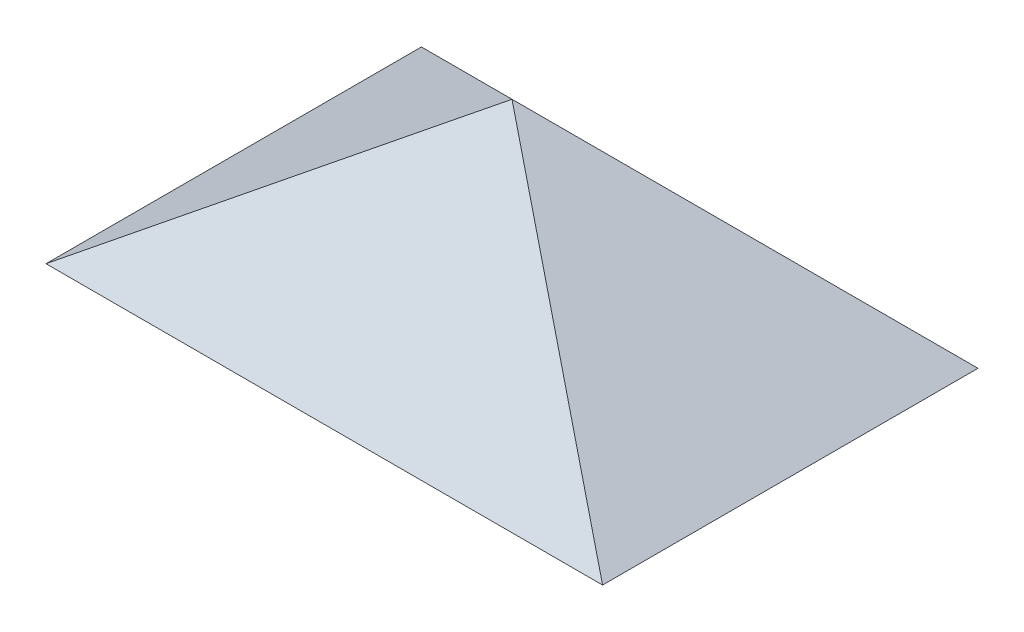
ISO-10303-21;
HEADER;
FILE_DESCRIPTION(('STEP AP214'),'2;1');
FILE_NAME('part.step','',(''),(''),'','','');
FILE_SCHEMA(('AUTOMOTIVE_DESIGN { 1 0 10303 214 1 1 1 1 }'));
ENDSEC;
DATA;
#1=APPLICATION_CONTEXT('core data for automotive mechanical design processes');
#2=APPLICATION_PROTOCOL_DEFINITION('international standard','automotive_design',2000,#1);
#3=PRODUCT_CONTEXT('',#1,'mechanical');
#4=PRODUCT('Part','Part','',(#3));
#5=PRODUCT_RELATED_PRODUCT_CATEGORY('part','',(#4));
#6=PRODUCT_DEFINITION_FORMATION('','',#4);
#7=PRODUCT_DEFINITION_CONTEXT('part definition',#1,'design');
#8=PRODUCT_DEFINITION('design','',#6,#7);
#9=PRODUCT_DEFINITION_SHAPE('','',#8);
#10=(LENGTH_UNIT() NAMED_UNIT(*) SI_UNIT(.MILLI.,.METRE.));
#11=(NAMED_UNIT(*) PLANE_ANGLE_UNIT() SI_UNIT($,.RADIAN.));
#12=(NAMED_UNIT(*) SI_UNIT($,.STERADIAN.) SOLID_ANGLE_UNIT());
#13=UNCERTAINTY_MEASURE_WITH_UNIT(LENGTH_MEASURE(1.E-05),#10,'distance_accuracy_value','');
#14=(GEOMETRIC_REPRESENTATION_CONTEXT(3) GLOBAL_UNCERTAINTY_ASSIGNED_CONTEXT((#13)) GLOBAL_UNIT_ASSIGNED_CONTEXT((#10,
#11,#12)) REPRESENTATION_CONTEXT('',''));
#15=CARTESIAN_POINT('',(0.,0.,0.));
#16=DIRECTION('',(0.,0.,1.));
#17=DIRECTION('',(1.,0.,0.));
#18=AXIS2_PLACEMENT_3D('',#15,#16,#17);
#19=CARTESIAN_POINT('',(0.,-68.1115915562036,0.));
#20=DIRECTION('',(0.,1.,0.));
#21=DIRECTION('',(0.,0.,1.));
#22=AXIS2_PLACEMENT_3D('',#19,#20,#21);
#23=PLANE('',#22);
#24=DIRECTION('',(0.,0.,1.));
#25=VECTOR('',#24,1.);
#26=CARTESIAN_POINT('',(77.5379386531959,-68.1115915562036,0.));
#27=LINE('',#26,#25);
#28=CARTESIAN_POINT('',(77.5379386531959,-68.1115915562036,-52.299999999986));
#29=VERTEX_POINT('',#28);
#30=CARTESIAN_POINT('',(77.5379386531959,-68.1115915562036,52.299999999986));
#31=VERTEX_POINT('',#30);
#32=EDGE_CURVE('E76',#29,#31,#27,.T.);
#33=ORIENTED_EDGE('',*,*,#32,.T.);
#34=DIRECTION('',(-1.,0.,0.));
#35=VECTOR('',#34,1.);
#36=CARTESIAN_POINT('',(0.,-68.1115915562036,52.299999999986));
#37=LINE('',#36,#35);
#38=CARTESIAN_POINT('',(-77.5379386531952,-68.1115915562036,52.299999999986));
#39=VERTEX_POINT('',#38);
#40=EDGE_CURVE('E59',#31,#39,#37,.T.);
#41=ORIENTED_EDGE('',*,*,#40,.T.);
#42=DIRECTION('',(0.,0.,-1.));
#43=VECTOR('',#42,1.);
#44=CARTESIAN_POINT('',(-77.5379386531953,-68.1115915562036,0.));
#45=LINE('',#44,#43);
#46=CARTESIAN_POINT('',(-77.5379386531953,-68.1115915562036,-52.299999999986));
#47=VERTEX_POINT('',#46);
#48=EDGE_CURVE('E74',#39,#47,#45,.T.);
#49=ORIENTED_EDGE('',*,*,#48,.T.);
#50=DIRECTION('',(1.,0.,0.));
#51=VECTOR('',#50,1.);
#52=CARTESIAN_POINT('',(0.,-68.1115915562036,-52.299999999986));
#53=LINE('',#52,#51);
#54=EDGE_CURVE('E51',#47,#29,#53,.T.);
#55=ORIENTED_EDGE('',*,*,#54,.T.);
#56=EDGE_LOOP('',(#33,#41,#49,#55));
#57=FACE_BOUND('',#56,.T.);
#58=ADVANCED_FACE('F37',(#57),#23,.F.);
#59=CARTESIAN_POINT('',(3.41228375186198E-13,-15.8115915562178,-750.));
#60=DIRECTION('',(-0.559192903470745,-0.829037572555043,0.));
#61=DIRECTION('',(0.829037572555043,-0.559192903470745,0.));
#62=AXIS2_PLACEMENT_3D('',#59,#60,#61);
#63=PLANE('',#62);
#64=DIRECTION('',(-0.723589100218008,0.488067010791393,0.488067010791395));
#65=VECTOR('',#64,1.);
#66=CARTESIAN_POINT('',(264.869976888479,-194.468646823353,-178.657055267136));
#67=LINE('',#66,#65);
#68=CARTESIAN_POINT('',(3.46944695195361E-13,-15.8115915562178,0.));
#69=VERTEX_POINT('',#68);
#70=EDGE_CURVE('E84',#29,#69,#67,.T.);
#71=ORIENTED_EDGE('',*,*,#70,.T.);
#72=DIRECTION('',(0.723589100218008,-0.488067010791393,0.488067010791395));
#73=VECTOR('',#72,1.);
#74=CARTESIAN_POINT('',(-264.869976888478,162.845463710917,-178.657055267136));
#75=LINE('',#74,#73);
#76=EDGE_CURVE('E67',#69,#31,#75,.T.);
#77=ORIENTED_EDGE('',*,*,#76,.T.);
#78=ORIENTED_EDGE('',*,*,#32,.F.);
#79=EDGE_LOOP('',(#71,#77,#78));
#80=FACE_BOUND('',#79,.T.);
#81=ADVANCED_FACE('F86',(#80),#63,.F.);
#82=CARTESIAN_POINT('',(3.41228375186198E-13,-15.8115915562178,-750.));
#83=DIRECTION('',(0.559192903470745,-0.829037572555043,0.));
#84=DIRECTION('',(0.829037572555043,0.559192903470745,0.));
#85=AXIS2_PLACEMENT_3D('',#82,#83,#84);
#86=PLANE('',#85);
#87=ORIENTED_EDGE('',*,*,#48,.F.);
#88=DIRECTION('',(0.723589100218008,0.488067010791393,-0.488067010791395));
#89=VECTOR('',#88,1.);
#90=CARTESIAN_POINT('',(264.869976888479,162.845463710917,-178.657055267136));
#91=LINE('',#90,#89);
#92=EDGE_CURVE('E11',#39,#69,#91,.T.);
#93=ORIENTED_EDGE('',*,*,#92,.T.);
#94=DIRECTION('',(-0.723589100218008,-0.488067010791393,-0.488067010791395));
#95=VECTOR('',#94,1.);
#96=CARTESIAN_POINT('',(-264.869976888478,-194.468646823353,-178.657055267136));
#97=LINE('',#96,#95);
#98=EDGE_CURVE('E44',#69,#47,#97,.T.);
#99=ORIENTED_EDGE('',*,*,#98,.T.);
#100=EDGE_LOOP('',(#87,#93,#99));
#101=FACE_BOUND('',#100,.T.);
#102=ADVANCED_FACE('F78',(#101),#86,.F.);
#103=CARTESIAN_POINT('',(77.5379386531959,-15.8115915562178,0.));
#104=DIRECTION('',(0.,-0.707106781186549,0.707106781186546));
#105=DIRECTION('',(0.,-0.707106781186546,-0.707106781186549));
#106=AXIS2_PLACEMENT_3D('',#103,#104,#105);
#107=PLANE('',#106);
#108=ORIENTED_EDGE('',*,*,#98,.F.);
#109=ORIENTED_EDGE('',*,*,#70,.F.);
#110=ORIENTED_EDGE('',*,*,#54,.F.);
#111=EDGE_LOOP('',(#108,#109,#110));
#112=FACE_BOUND('',#111,.T.);
#113=ADVANCED_FACE('F87',(#112),#107,.F.);
#114=CARTESIAN_POINT('',(77.5379386531959,-15.8115915562178,0.));
#115=DIRECTION('',(0.,-0.707106781186549,-0.707106781186546));
#116=DIRECTION('',(0.,0.707106781186546,-0.707106781186549));
#117=AXIS2_PLACEMENT_3D('',#114,#115,#116);
#118=PLANE('',#117);
#119=ORIENTED_EDGE('',*,*,#76,.F.);
#120=ORIENTED_EDGE('',*,*,#92,.F.);
#121=ORIENTED_EDGE('',*,*,#40,.F.);
#122=EDGE_LOOP('',(#119,#120,#121));
#123=FACE_BOUND('',#122,.T.);
#124=ADVANCED_FACE('F66',(#123),#118,.F.);
#125=CLOSED_SHELL('',(#58,#81,#102,#113,#124));
#126=MANIFOLD_SOLID_BREP('B2',#125);
#127=ADVANCED_BREP_SHAPE_REPRESENTATION('',(#18,#126),#14);
#128=SHAPE_DEFINITION_REPRESENTATION(#9,#127);
ENDSEC;
END-ISO-10303-21;
